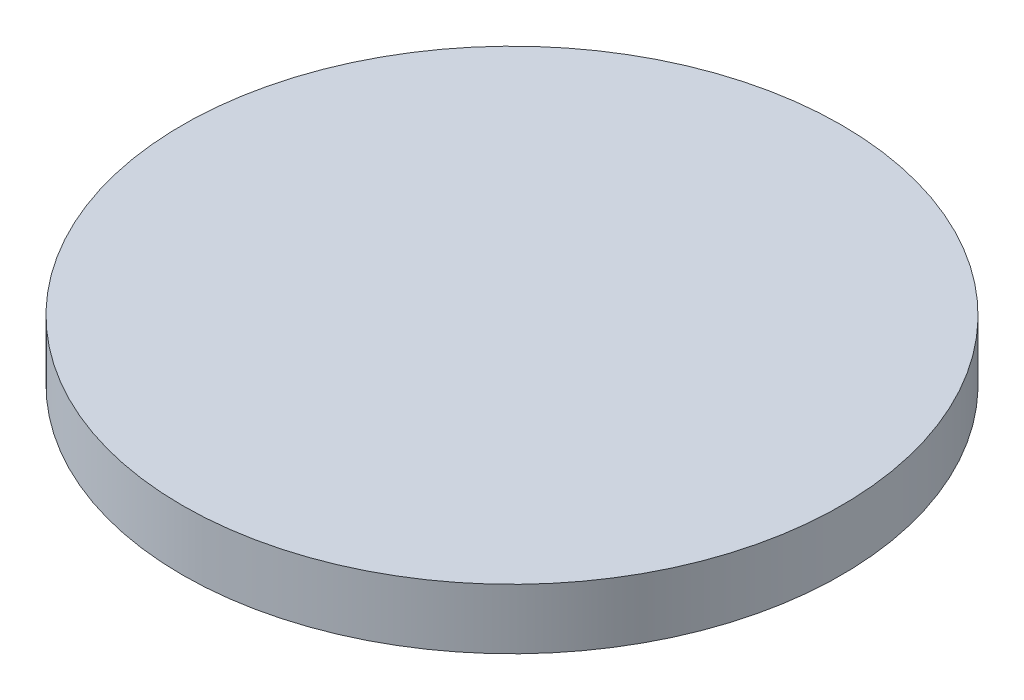
ISO-10303-21;
HEADER;
FILE_DESCRIPTION(('STEP AP214'),'2;1');
FILE_NAME('part.step','',(''),(''),'','','');
FILE_SCHEMA(('AUTOMOTIVE_DESIGN { 1 0 10303 214 1 1 1 1 }'));
ENDSEC;
DATA;
#1=APPLICATION_CONTEXT('core data for automotive mechanical design processes');
#2=APPLICATION_PROTOCOL_DEFINITION('international standard','automotive_design',2000,#1);
#3=PRODUCT_CONTEXT('',#1,'mechanical');
#4=PRODUCT('Part','Part','',(#3));
#5=PRODUCT_RELATED_PRODUCT_CATEGORY('part','',(#4));
#6=PRODUCT_DEFINITION_FORMATION('','',#4);
#7=PRODUCT_DEFINITION_CONTEXT('part definition',#1,'design');
#8=PRODUCT_DEFINITION('design','',#6,#7);
#9=PRODUCT_DEFINITION_SHAPE('','',#8);
#10=(LENGTH_UNIT() NAMED_UNIT(*) SI_UNIT(.MILLI.,.METRE.));
#11=(NAMED_UNIT(*) PLANE_ANGLE_UNIT() SI_UNIT($,.RADIAN.));
#12=(NAMED_UNIT(*) SI_UNIT($,.STERADIAN.) SOLID_ANGLE_UNIT());
#13=UNCERTAINTY_MEASURE_WITH_UNIT(LENGTH_MEASURE(1.E-05),#10,'distance_accuracy_value','');
#14=(GEOMETRIC_REPRESENTATION_CONTEXT(3) GLOBAL_UNCERTAINTY_ASSIGNED_CONTEXT((#13)) GLOBAL_UNIT_ASSIGNED_CONTEXT((#10,
#11,#12)) REPRESENTATION_CONTEXT('',''));
#15=CARTESIAN_POINT('',(0.,0.,0.));
#16=DIRECTION('',(0.,0.,1.));
#17=DIRECTION('',(1.,0.,0.));
#18=AXIS2_PLACEMENT_3D('',#15,#16,#17);
#19=CARTESIAN_POINT('',(0.,2.1,0.));
#20=DIRECTION('',(0.,-1.,0.));
#21=DIRECTION('',(0.,0.,-1.));
#22=AXIS2_PLACEMENT_3D('',#19,#20,#21);
#23=CYLINDRICAL_SURFACE('',#22,11.5);
#24=CARTESIAN_POINT('',(0.,2.1,0.));
#25=DIRECTION('',(0.,1.,0.));
#26=DIRECTION('',(0.,0.,1.));
#27=AXIS2_PLACEMENT_3D('',#24,#25,#26);
#28=CIRCLE('',#27,11.5);
#29=CARTESIAN_POINT('',(0.,2.1,11.5));
#30=VERTEX_POINT('',#29);
#31=EDGE_CURVE('E12',#30,#30,#28,.T.);
#32=ORIENTED_EDGE('',*,*,#31,.F.);
#33=EDGE_LOOP('',(#32));
#34=FACE_BOUND('',#33,.T.);
#35=CARTESIAN_POINT('',(0.,0.,0.));
#36=DIRECTION('',(0.,1.,0.));
#37=DIRECTION('',(0.,0.,1.));
#38=AXIS2_PLACEMENT_3D('',#35,#36,#37);
#39=CIRCLE('',#38,11.5);
#40=CARTESIAN_POINT('',(0.,0.,11.5));
#41=VERTEX_POINT('',#40);
#42=EDGE_CURVE('E43',#41,#41,#39,.T.);
#43=ORIENTED_EDGE('',*,*,#42,.T.);
#44=EDGE_LOOP('',(#43));
#45=FACE_BOUND('',#44,.T.);
#46=ADVANCED_FACE('F40',(#34,#45),#23,.T.);
#47=CARTESIAN_POINT('',(0.,2.1,0.));
#48=DIRECTION('',(0.,1.,0.));
#49=DIRECTION('',(0.,0.,1.));
#50=AXIS2_PLACEMENT_3D('',#47,#48,#49);
#51=PLANE('',#50);
#52=ORIENTED_EDGE('',*,*,#31,.T.);
#53=EDGE_LOOP('',(#52));
#54=FACE_BOUND('',#53,.T.);
#55=ADVANCED_FACE('F55',(#54),#51,.T.);
#56=CARTESIAN_POINT('',(0.,0.,0.));
#57=DIRECTION('',(0.,1.,0.));
#58=DIRECTION('',(0.,0.,1.));
#59=AXIS2_PLACEMENT_3D('',#56,#57,#58);
#60=PLANE('',#59);
#61=ORIENTED_EDGE('',*,*,#42,.F.);
#62=EDGE_LOOP('',(#61));
#63=FACE_BOUND('',#62,.T.);
#64=ADVANCED_FACE('F53',(#63),#60,.F.);
#65=CLOSED_SHELL('',(#46,#55,#64));
#66=MANIFOLD_SOLID_BREP('B2',#65);
#67=ADVANCED_BREP_SHAPE_REPRESENTATION('',(#18,#66),#14);
#68=SHAPE_DEFINITION_REPRESENTATION(#9,#67);
ENDSEC;
END-ISO-10303-21;
